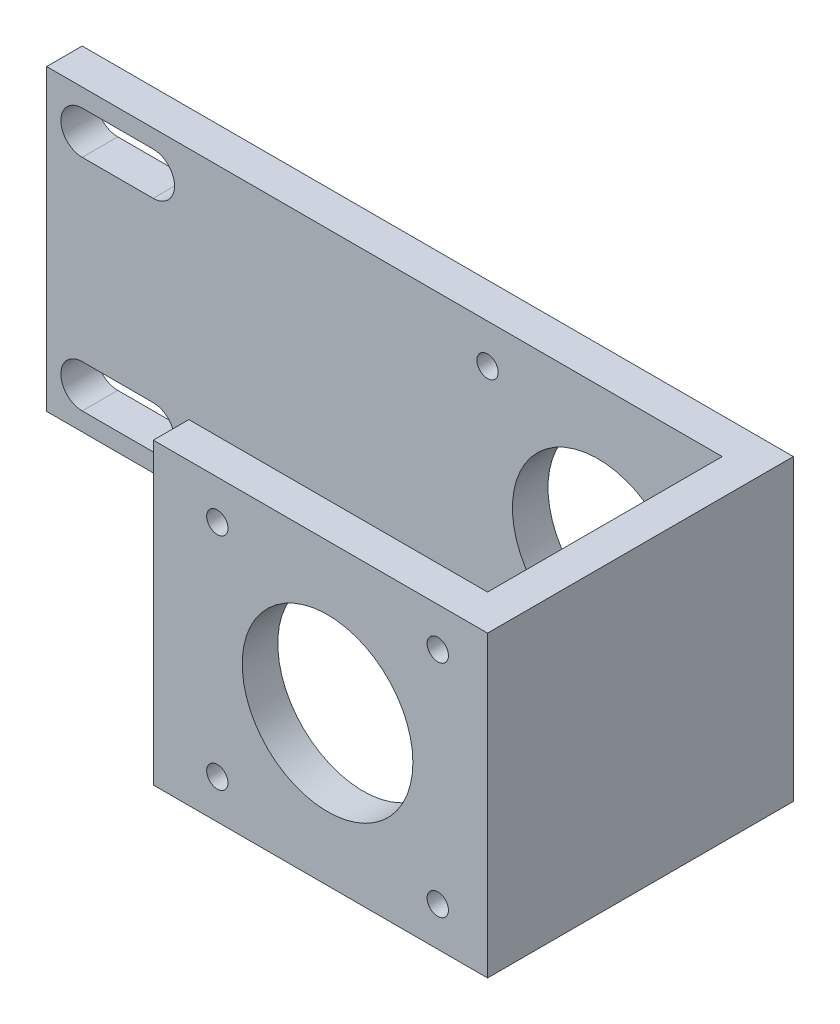
ISO-10303-21;
HEADER;
FILE_DESCRIPTION(('STEP AP214'),'2;1');
FILE_NAME('part.step','',(''),(''),'','','');
FILE_SCHEMA(('AUTOMOTIVE_DESIGN { 1 0 10303 214 1 1 1 1 }'));
ENDSEC;
DATA;
#1=APPLICATION_CONTEXT('core data for automotive mechanical design processes');
#2=APPLICATION_PROTOCOL_DEFINITION('international standard','automotive_design',2000,#1);
#3=PRODUCT_CONTEXT('',#1,'mechanical');
#4=PRODUCT('Part','Part','',(#3));
#5=PRODUCT_RELATED_PRODUCT_CATEGORY('part','',(#4));
#6=PRODUCT_DEFINITION_FORMATION('','',#4);
#7=PRODUCT_DEFINITION_CONTEXT('part definition',#1,'design');
#8=PRODUCT_DEFINITION('design','',#6,#7);
#9=PRODUCT_DEFINITION_SHAPE('','',#8);
#10=(LENGTH_UNIT() NAMED_UNIT(*) SI_UNIT(.MILLI.,.METRE.));
#11=(NAMED_UNIT(*) PLANE_ANGLE_UNIT() SI_UNIT($,.RADIAN.));
#12=(NAMED_UNIT(*) SI_UNIT($,.STERADIAN.) SOLID_ANGLE_UNIT());
#13=UNCERTAINTY_MEASURE_WITH_UNIT(LENGTH_MEASURE(1.E-05),#10,'distance_accuracy_value','');
#14=(GEOMETRIC_REPRESENTATION_CONTEXT(3) GLOBAL_UNCERTAINTY_ASSIGNED_CONTEXT((#13)) GLOBAL_UNIT_ASSIGNED_CONTEXT((#10,
#11,#12)) REPRESENTATION_CONTEXT('',''));
#15=CARTESIAN_POINT('',(0.,0.,0.));
#16=DIRECTION('',(0.,0.,1.));
#17=DIRECTION('',(1.,0.,0.));
#18=AXIS2_PLACEMENT_3D('',#15,#16,#17);
#19=CARTESIAN_POINT('',(45.,21.,43.));
#20=DIRECTION('',(1.,0.,0.));
#21=DIRECTION('',(0.,1.,0.));
#22=AXIS2_PLACEMENT_3D('',#19,#20,#21);
#23=PLANE('',#22);
#24=DIRECTION('',(0.,-1.,0.));
#25=VECTOR('',#24,1.);
#26=CARTESIAN_POINT('',(45.,-21.,38.));
#27=LINE('',#26,#25);
#28=CARTESIAN_POINT('',(45.,21.,38.));
#29=VERTEX_POINT('',#28);
#30=CARTESIAN_POINT('',(45.,-21.,38.));
#31=VERTEX_POINT('',#30);
#32=EDGE_CURVE('E614',#29,#31,#27,.T.);
#33=ORIENTED_EDGE('',*,*,#32,.F.);
#34=DIRECTION('',(0.,0.,-1.));
#35=VECTOR('',#34,1.);
#36=CARTESIAN_POINT('',(45.,21.,43.));
#37=LINE('',#36,#35);
#38=CARTESIAN_POINT('',(45.,21.,5.));
#39=VERTEX_POINT('',#38);
#40=EDGE_CURVE('E54',#29,#39,#37,.T.);
#41=ORIENTED_EDGE('',*,*,#40,.T.);
#42=DIRECTION('',(0.,-1.,0.));
#43=VECTOR('',#42,1.);
#44=CARTESIAN_POINT('',(45.,21.,5.));
#45=LINE('',#44,#43);
#46=CARTESIAN_POINT('',(45.,-21.,5.));
#47=VERTEX_POINT('',#46);
#48=EDGE_CURVE('E234',#39,#47,#45,.T.);
#49=ORIENTED_EDGE('',*,*,#48,.T.);
#50=DIRECTION('',(0.,0.,-1.));
#51=VECTOR('',#50,1.);
#52=CARTESIAN_POINT('',(45.,-21.,43.));
#53=LINE('',#52,#51);
#54=EDGE_CURVE('E243',#31,#47,#53,.T.);
#55=ORIENTED_EDGE('',*,*,#54,.F.);
#56=EDGE_LOOP('',(#33,#41,#49,#55));
#57=FACE_BOUND('',#56,.T.);
#58=ADVANCED_FACE('F37',(#57),#23,.F.);
#59=CARTESIAN_POINT('',(-45.,15.44,5.));
#60=DIRECTION('',(0.,0.,-1.));
#61=DIRECTION('',(-1.,0.,0.));
#62=AXIS2_PLACEMENT_3D('',#59,#60,#61);
#63=CYLINDRICAL_SURFACE('',#62,3.);
#64=CARTESIAN_POINT('',(-45.,15.44,0.));
#65=DIRECTION('',(0.,0.,1.));
#66=DIRECTION('',(1.,0.,0.));
#67=AXIS2_PLACEMENT_3D('',#64,#65,#66);
#68=CIRCLE('',#67,3.);
#69=CARTESIAN_POINT('',(-45.,18.44,0.));
#70=VERTEX_POINT('',#69);
#71=CARTESIAN_POINT('',(-45.,12.44,0.));
#72=VERTEX_POINT('',#71);
#73=EDGE_CURVE('E189',#70,#72,#68,.T.);
#74=ORIENTED_EDGE('',*,*,#73,.F.);
#75=DIRECTION('',(0.,0.,-1.));
#76=VECTOR('',#75,1.);
#77=CARTESIAN_POINT('',(-45.,18.44,5.));
#78=LINE('',#77,#76);
#79=CARTESIAN_POINT('',(-45.,18.44,5.));
#80=VERTEX_POINT('',#79);
#81=EDGE_CURVE('E11',#80,#70,#78,.T.);
#82=ORIENTED_EDGE('',*,*,#81,.F.);
#83=CARTESIAN_POINT('',(-45.,15.44,5.));
#84=DIRECTION('',(0.,0.,1.));
#85=DIRECTION('',(1.,0.,0.));
#86=AXIS2_PLACEMENT_3D('',#83,#84,#85);
#87=CIRCLE('',#86,3.);
#88=CARTESIAN_POINT('',(-45.,12.44,5.));
#89=VERTEX_POINT('',#88);
#90=EDGE_CURVE('E146',#80,#89,#87,.T.);
#91=ORIENTED_EDGE('',*,*,#90,.T.);
#92=DIRECTION('',(0.,0.,-1.));
#93=VECTOR('',#92,1.);
#94=CARTESIAN_POINT('',(-45.,12.44,5.));
#95=LINE('',#94,#93);
#96=EDGE_CURVE('E63',#89,#72,#95,.T.);
#97=ORIENTED_EDGE('',*,*,#96,.T.);
#98=EDGE_LOOP('',(#74,#82,#91,#97));
#99=FACE_BOUND('',#98,.T.);
#100=ADVANCED_FACE('F291',(#99),#63,.F.);
#101=CARTESIAN_POINT('',(0.,18.44,5.));
#102=DIRECTION('',(0.,1.,0.));
#103=DIRECTION('',(0.,0.,1.));
#104=AXIS2_PLACEMENT_3D('',#101,#102,#103);
#105=PLANE('',#104);
#106=DIRECTION('',(1.,0.,0.));
#107=VECTOR('',#106,1.);
#108=CARTESIAN_POINT('',(0.,18.44,0.));
#109=LINE('',#108,#107);
#110=CARTESIAN_POINT('',(-35.0214124085083,18.44,0.));
#111=VERTEX_POINT('',#110);
#112=EDGE_CURVE('E152',#70,#111,#109,.T.);
#113=ORIENTED_EDGE('',*,*,#112,.T.);
#114=DIRECTION('',(0.,0.,-1.));
#115=VECTOR('',#114,1.);
#116=CARTESIAN_POINT('',(-35.0214124085083,18.44,5.));
#117=LINE('',#116,#115);
#118=CARTESIAN_POINT('',(-35.0214124085083,18.44,5.));
#119=VERTEX_POINT('',#118);
#120=EDGE_CURVE('E46',#119,#111,#117,.T.);
#121=ORIENTED_EDGE('',*,*,#120,.F.);
#122=DIRECTION('',(1.,0.,0.));
#123=VECTOR('',#122,1.);
#124=CARTESIAN_POINT('',(0.,18.44,5.));
#125=LINE('',#124,#123);
#126=EDGE_CURVE('E140',#80,#119,#125,.T.);
#127=ORIENTED_EDGE('',*,*,#126,.F.);
#128=ORIENTED_EDGE('',*,*,#81,.T.);
#129=EDGE_LOOP('',(#113,#121,#127,#128));
#130=FACE_BOUND('',#129,.T.);
#131=ADVANCED_FACE('F150',(#130),#105,.F.);
#132=CARTESIAN_POINT('',(-35.0214124085083,15.44,5.));
#133=DIRECTION('',(0.,0.,-1.));
#134=DIRECTION('',(-1.,0.,0.));
#135=AXIS2_PLACEMENT_3D('',#132,#133,#134);
#136=CYLINDRICAL_SURFACE('',#135,3.);
#137=CARTESIAN_POINT('',(-35.0214124085083,15.44,0.));
#138=DIRECTION('',(0.,0.,1.));
#139=DIRECTION('',(1.,0.,0.));
#140=AXIS2_PLACEMENT_3D('',#137,#138,#139);
#141=CIRCLE('',#140,3.);
#142=CARTESIAN_POINT('',(-35.0214124085083,12.44,0.));
#143=VERTEX_POINT('',#142);
#144=EDGE_CURVE('E192',#143,#111,#141,.T.);
#145=ORIENTED_EDGE('',*,*,#144,.F.);
#146=DIRECTION('',(0.,0.,-1.));
#147=VECTOR('',#146,1.);
#148=CARTESIAN_POINT('',(-35.0214124085083,12.44,5.));
#149=LINE('',#148,#147);
#150=CARTESIAN_POINT('',(-35.0214124085083,12.44,5.));
#151=VERTEX_POINT('',#150);
#152=EDGE_CURVE('E156',#151,#143,#149,.T.);
#153=ORIENTED_EDGE('',*,*,#152,.F.);
#154=CARTESIAN_POINT('',(-35.0214124085083,15.44,5.));
#155=DIRECTION('',(0.,0.,1.));
#156=DIRECTION('',(1.,0.,0.));
#157=AXIS2_PLACEMENT_3D('',#154,#155,#156);
#158=CIRCLE('',#157,3.);
#159=EDGE_CURVE('E145',#151,#119,#158,.T.);
#160=ORIENTED_EDGE('',*,*,#159,.T.);
#161=ORIENTED_EDGE('',*,*,#120,.T.);
#162=EDGE_LOOP('',(#145,#153,#160,#161));
#163=FACE_BOUND('',#162,.T.);
#164=ADVANCED_FACE('F158',(#163),#136,.F.);
#165=CARTESIAN_POINT('',(0.,21.,5.));
#166=DIRECTION('',(0.,1.,0.));
#167=DIRECTION('',(-1.,0.,0.));
#168=AXIS2_PLACEMENT_3D('',#165,#166,#167);
#169=PLANE('',#168);
#170=DIRECTION('',(1.,0.,0.));
#171=VECTOR('',#170,1.);
#172=CARTESIAN_POINT('',(0.,21.,0.));
#173=LINE('',#172,#171);
#174=CARTESIAN_POINT('',(-50.,21.,0.));
#175=VERTEX_POINT('',#174);
#176=CARTESIAN_POINT('',(50.,21.,0.));
#177=VERTEX_POINT('',#176);
#178=EDGE_CURVE('E177',#175,#177,#173,.T.);
#179=ORIENTED_EDGE('',*,*,#178,.F.);
#180=DIRECTION('',(0.,0.,-1.));
#181=VECTOR('',#180,1.);
#182=CARTESIAN_POINT('',(-50.,21.,5.));
#183=LINE('',#182,#181);
#184=CARTESIAN_POINT('',(-50.,21.,5.));
#185=VERTEX_POINT('',#184);
#186=EDGE_CURVE('E199',#185,#175,#183,.T.);
#187=ORIENTED_EDGE('',*,*,#186,.F.);
#188=DIRECTION('',(1.,0.,0.));
#189=VECTOR('',#188,1.);
#190=CARTESIAN_POINT('',(0.,21.,5.));
#191=LINE('',#190,#189);
#192=EDGE_CURVE('E215',#185,#39,#191,.T.);
#193=ORIENTED_EDGE('',*,*,#192,.T.);
#194=ORIENTED_EDGE('',*,*,#40,.F.);
#195=DIRECTION('',(1.,0.,0.));
#196=VECTOR('',#195,1.);
#197=CARTESIAN_POINT('',(3.,21.,38.));
#198=LINE('',#197,#196);
#199=CARTESIAN_POINT('',(3.,21.,38.));
#200=VERTEX_POINT('',#199);
#201=EDGE_CURVE('E245',#200,#29,#198,.T.);
#202=ORIENTED_EDGE('',*,*,#201,.F.);
#203=DIRECTION('',(0.,0.,-1.));
#204=VECTOR('',#203,1.);
#205=CARTESIAN_POINT('',(3.,21.,43.));
#206=LINE('',#205,#204);
#207=CARTESIAN_POINT('',(3.,21.,43.));
#208=VERTEX_POINT('',#207);
#209=EDGE_CURVE('E618',#208,#200,#206,.T.);
#210=ORIENTED_EDGE('',*,*,#209,.F.);
#211=DIRECTION('',(-1.,0.,0.));
#212=VECTOR('',#211,1.);
#213=CARTESIAN_POINT('',(50.,21.,43.));
#214=LINE('',#213,#212);
#215=CARTESIAN_POINT('',(50.,21.,43.));
#216=VERTEX_POINT('',#215);
#217=EDGE_CURVE('E247',#216,#208,#214,.T.);
#218=ORIENTED_EDGE('',*,*,#217,.F.);
#219=DIRECTION('',(0.,0.,-1.));
#220=VECTOR('',#219,1.);
#221=CARTESIAN_POINT('',(50.,21.,5.));
#222=LINE('',#221,#220);
#223=EDGE_CURVE('E201',#216,#177,#222,.T.);
#224=ORIENTED_EDGE('',*,*,#223,.T.);
#225=EDGE_LOOP('',(#179,#187,#193,#194,#202,#210,#218,#224));
#226=FACE_BOUND('',#225,.T.);
#227=ADVANCED_FACE('F312',(#226),#169,.T.);
#228=CARTESIAN_POINT('',(-50.,0.,5.));
#229=DIRECTION('',(1.,0.,0.));
#230=DIRECTION('',(0.,0.,-1.));
#231=AXIS2_PLACEMENT_3D('',#228,#229,#230);
#232=PLANE('',#231);
#233=DIRECTION('',(0.,-1.,0.));
#234=VECTOR('',#233,1.);
#235=CARTESIAN_POINT('',(-50.,0.,0.));
#236=LINE('',#235,#234);
#237=CARTESIAN_POINT('',(-50.,-21.,0.));
#238=VERTEX_POINT('',#237);
#239=EDGE_CURVE('E180',#175,#238,#236,.T.);
#240=ORIENTED_EDGE('',*,*,#239,.T.);
#241=DIRECTION('',(0.,0.,-1.));
#242=VECTOR('',#241,1.);
#243=CARTESIAN_POINT('',(-50.,-21.,5.));
#244=LINE('',#243,#242);
#245=CARTESIAN_POINT('',(-50.,-21.,5.));
#246=VERTEX_POINT('',#245);
#247=EDGE_CURVE('E205',#246,#238,#244,.T.);
#248=ORIENTED_EDGE('',*,*,#247,.F.);
#249=DIRECTION('',(0.,-1.,0.));
#250=VECTOR('',#249,1.);
#251=CARTESIAN_POINT('',(-50.,0.,5.));
#252=LINE('',#251,#250);
#253=EDGE_CURVE('E219',#185,#246,#252,.T.);
#254=ORIENTED_EDGE('',*,*,#253,.F.);
#255=ORIENTED_EDGE('',*,*,#186,.T.);
#256=EDGE_LOOP('',(#240,#248,#254,#255));
#257=FACE_BOUND('',#256,.T.);
#258=ADVANCED_FACE('F288',(#257),#232,.F.);
#259=CARTESIAN_POINT('',(0.,-21.,5.));
#260=DIRECTION('',(0.,1.,0.));
#261=DIRECTION('',(0.,0.,1.));
#262=AXIS2_PLACEMENT_3D('',#259,#260,#261);
#263=PLANE('',#262);
#264=DIRECTION('',(1.,0.,0.));
#265=VECTOR('',#264,1.);
#266=CARTESIAN_POINT('',(0.,-21.,0.));
#267=LINE('',#266,#265);
#268=CARTESIAN_POINT('',(50.,-21.,0.));
#269=VERTEX_POINT('',#268);
#270=EDGE_CURVE('E183',#238,#269,#267,.T.);
#271=ORIENTED_EDGE('',*,*,#270,.T.);
#272=DIRECTION('',(0.,0.,-1.));
#273=VECTOR('',#272,1.);
#274=CARTESIAN_POINT('',(50.,-21.,5.));
#275=LINE('',#274,#273);
#276=CARTESIAN_POINT('',(50.,-21.,43.));
#277=VERTEX_POINT('',#276);
#278=EDGE_CURVE('E203',#277,#269,#275,.T.);
#279=ORIENTED_EDGE('',*,*,#278,.F.);
#280=DIRECTION('',(1.,0.,0.));
#281=VECTOR('',#280,1.);
#282=CARTESIAN_POINT('',(50.,-21.,43.));
#283=LINE('',#282,#281);
#284=CARTESIAN_POINT('',(3.,-21.,43.));
#285=VERTEX_POINT('',#284);
#286=EDGE_CURVE('E259',#285,#277,#283,.T.);
#287=ORIENTED_EDGE('',*,*,#286,.F.);
#288=DIRECTION('',(0.,0.,1.));
#289=VECTOR('',#288,1.);
#290=CARTESIAN_POINT('',(3.,-21.,43.));
#291=LINE('',#290,#289);
#292=CARTESIAN_POINT('',(3.,-21.,38.));
#293=VERTEX_POINT('',#292);
#294=EDGE_CURVE('E624',#293,#285,#291,.T.);
#295=ORIENTED_EDGE('',*,*,#294,.F.);
#296=DIRECTION('',(1.,0.,0.));
#297=VECTOR('',#296,1.);
#298=CARTESIAN_POINT('',(3.,-21.,38.));
#299=LINE('',#298,#297);
#300=EDGE_CURVE('E250',#293,#31,#299,.T.);
#301=ORIENTED_EDGE('',*,*,#300,.T.);
#302=ORIENTED_EDGE('',*,*,#54,.T.);
#303=DIRECTION('',(1.,0.,0.));
#304=VECTOR('',#303,1.);
#305=CARTESIAN_POINT('',(0.,-21.,5.));
#306=LINE('',#305,#304);
#307=EDGE_CURVE('E221',#246,#47,#306,.T.);
#308=ORIENTED_EDGE('',*,*,#307,.F.);
#309=ORIENTED_EDGE('',*,*,#247,.T.);
#310=EDGE_LOOP('',(#271,#279,#287,#295,#301,#302,#308,#309));
#311=FACE_BOUND('',#310,.T.);
#312=ADVANCED_FACE('F283',(#311),#263,.F.);
#313=CARTESIAN_POINT('',(0.,-18.44,5.));
#314=DIRECTION('',(0.,1.,0.));
#315=DIRECTION('',(0.,0.,1.));
#316=AXIS2_PLACEMENT_3D('',#313,#314,#315);
#317=PLANE('',#316);
#318=DIRECTION('',(1.,0.,0.));
#319=VECTOR('',#318,1.);
#320=CARTESIAN_POINT('',(0.,-18.44,0.));
#321=LINE('',#320,#319);
#322=CARTESIAN_POINT('',(-45.,-18.44,0.));
#323=VERTEX_POINT('',#322);
#324=CARTESIAN_POINT('',(-35.0214124085083,-18.44,0.));
#325=VERTEX_POINT('',#324);
#326=EDGE_CURVE('E165',#323,#325,#321,.T.);
#327=ORIENTED_EDGE('',*,*,#326,.F.);
#328=DIRECTION('',(0.,0.,-1.));
#329=VECTOR('',#328,1.);
#330=CARTESIAN_POINT('',(-45.,-18.44,5.));
#331=LINE('',#330,#329);
#332=CARTESIAN_POINT('',(-45.,-18.44,5.));
#333=VERTEX_POINT('',#332);
#334=EDGE_CURVE('E113',#333,#323,#331,.T.);
#335=ORIENTED_EDGE('',*,*,#334,.F.);
#336=DIRECTION('',(1.,0.,0.));
#337=VECTOR('',#336,1.);
#338=CARTESIAN_POINT('',(0.,-18.44,5.));
#339=LINE('',#338,#337);
#340=CARTESIAN_POINT('',(-35.0214124085083,-18.44,5.));
#341=VERTEX_POINT('',#340);
#342=EDGE_CURVE('E197',#333,#341,#339,.T.);
#343=ORIENTED_EDGE('',*,*,#342,.T.);
#344=DIRECTION('',(0.,0.,-1.));
#345=VECTOR('',#344,1.);
#346=CARTESIAN_POINT('',(-35.0214124085083,-18.44,5.));
#347=LINE('',#346,#345);
#348=EDGE_CURVE('E161',#341,#325,#347,.T.);
#349=ORIENTED_EDGE('',*,*,#348,.T.);
#350=EDGE_LOOP('',(#327,#335,#343,#349));
#351=FACE_BOUND('',#350,.T.);
#352=ADVANCED_FACE('F39',(#351),#317,.T.);
#353=CARTESIAN_POINT('',(-45.,-15.44,5.));
#354=DIRECTION('',(0.,0.,-1.));
#355=DIRECTION('',(-1.,0.,0.));
#356=AXIS2_PLACEMENT_3D('',#353,#354,#355);
#357=CYLINDRICAL_SURFACE('',#356,3.);
#358=CARTESIAN_POINT('',(-45.,-15.44,0.));
#359=DIRECTION('',(0.,0.,1.));
#360=DIRECTION('',(1.,0.,0.));
#361=AXIS2_PLACEMENT_3D('',#358,#359,#360);
#362=CIRCLE('',#361,3.);
#363=CARTESIAN_POINT('',(-45.,-12.44,0.));
#364=VERTEX_POINT('',#363);
#365=EDGE_CURVE('E168',#364,#323,#362,.T.);
#366=ORIENTED_EDGE('',*,*,#365,.F.);
#367=DIRECTION('',(0.,0.,-1.));
#368=VECTOR('',#367,1.);
#369=CARTESIAN_POINT('',(-45.,-12.44,5.));
#370=LINE('',#369,#368);
#371=CARTESIAN_POINT('',(-45.,-12.44,5.));
#372=VERTEX_POINT('',#371);
#373=EDGE_CURVE('E212',#372,#364,#370,.T.);
#374=ORIENTED_EDGE('',*,*,#373,.F.);
#375=CARTESIAN_POINT('',(-45.,-15.44,5.));
#376=DIRECTION('',(0.,0.,1.));
#377=DIRECTION('',(1.,0.,0.));
#378=AXIS2_PLACEMENT_3D('',#375,#376,#377);
#379=CIRCLE('',#378,3.);
#380=EDGE_CURVE('E262',#372,#333,#379,.T.);
#381=ORIENTED_EDGE('',*,*,#380,.T.);
#382=ORIENTED_EDGE('',*,*,#334,.T.);
#383=EDGE_LOOP('',(#366,#374,#381,#382));
#384=FACE_BOUND('',#383,.T.);
#385=ADVANCED_FACE('F275',(#384),#357,.F.);
#386=CARTESIAN_POINT('',(0.,-12.44,5.));
#387=DIRECTION('',(0.,1.,0.));
#388=DIRECTION('',(0.,0.,1.));
#389=AXIS2_PLACEMENT_3D('',#386,#387,#388);
#390=PLANE('',#389);
#391=DIRECTION('',(1.,0.,0.));
#392=VECTOR('',#391,1.);
#393=CARTESIAN_POINT('',(0.,-12.44,0.));
#394=LINE('',#393,#392);
#395=CARTESIAN_POINT('',(-35.0214124085083,-12.44,0.));
#396=VERTEX_POINT('',#395);
#397=EDGE_CURVE('E171',#364,#396,#394,.T.);
#398=ORIENTED_EDGE('',*,*,#397,.T.);
#399=DIRECTION('',(0.,0.,-1.));
#400=VECTOR('',#399,1.);
#401=CARTESIAN_POINT('',(-35.0214124085083,-12.44,5.));
#402=LINE('',#401,#400);
#403=CARTESIAN_POINT('',(-35.0214124085083,-12.44,5.));
#404=VERTEX_POINT('',#403);
#405=EDGE_CURVE('E210',#404,#396,#402,.T.);
#406=ORIENTED_EDGE('',*,*,#405,.F.);
#407=DIRECTION('',(1.,0.,0.));
#408=VECTOR('',#407,1.);
#409=CARTESIAN_POINT('',(0.,-12.44,5.));
#410=LINE('',#409,#408);
#411=EDGE_CURVE('E264',#372,#404,#410,.T.);
#412=ORIENTED_EDGE('',*,*,#411,.F.);
#413=ORIENTED_EDGE('',*,*,#373,.T.);
#414=EDGE_LOOP('',(#398,#406,#412,#413));
#415=FACE_BOUND('',#414,.T.);
#416=ADVANCED_FACE('F278',(#415),#390,.F.);
#417=CARTESIAN_POINT('',(50.,0.,5.));
#418=DIRECTION('',(1.,0.,0.));
#419=DIRECTION('',(0.,0.,-1.));
#420=AXIS2_PLACEMENT_3D('',#417,#418,#419);
#421=PLANE('',#420);
#422=DIRECTION('',(0.,-1.,0.));
#423=VECTOR('',#422,1.);
#424=CARTESIAN_POINT('',(50.,0.,0.));
#425=LINE('',#424,#423);
#426=EDGE_CURVE('E186',#177,#269,#425,.T.);
#427=ORIENTED_EDGE('',*,*,#426,.F.);
#428=ORIENTED_EDGE('',*,*,#223,.F.);
#429=DIRECTION('',(0.,1.,0.));
#430=VECTOR('',#429,1.);
#431=CARTESIAN_POINT('',(50.,21.,43.));
#432=LINE('',#431,#430);
#433=EDGE_CURVE('E244',#277,#216,#432,.T.);
#434=ORIENTED_EDGE('',*,*,#433,.F.);
#435=ORIENTED_EDGE('',*,*,#278,.T.);
#436=EDGE_LOOP('',(#427,#428,#434,#435));
#437=FACE_BOUND('',#436,.T.);
#438=ADVANCED_FACE('F315',(#437),#421,.T.);
#439=CARTESIAN_POINT('',(-35.0214124085083,-15.44,5.));
#440=DIRECTION('',(0.,0.,-1.));
#441=DIRECTION('',(-1.,0.,0.));
#442=AXIS2_PLACEMENT_3D('',#439,#440,#441);
#443=CYLINDRICAL_SURFACE('',#442,3.);
#444=CARTESIAN_POINT('',(-35.0214124085083,-15.44,0.));
#445=DIRECTION('',(0.,0.,1.));
#446=DIRECTION('',(1.,0.,0.));
#447=AXIS2_PLACEMENT_3D('',#444,#445,#446);
#448=CIRCLE('',#447,3.);
#449=EDGE_CURVE('E174',#325,#396,#448,.T.);
#450=ORIENTED_EDGE('',*,*,#449,.F.);
#451=ORIENTED_EDGE('',*,*,#348,.F.);
#452=CARTESIAN_POINT('',(-35.0214124085083,-15.44,5.));
#453=DIRECTION('',(0.,0.,1.));
#454=DIRECTION('',(1.,0.,0.));
#455=AXIS2_PLACEMENT_3D('',#452,#453,#454);
#456=CIRCLE('',#455,3.);
#457=EDGE_CURVE('E220',#341,#404,#456,.T.);
#458=ORIENTED_EDGE('',*,*,#457,.T.);
#459=ORIENTED_EDGE('',*,*,#405,.T.);
#460=EDGE_LOOP('',(#450,#451,#458,#459));
#461=FACE_BOUND('',#460,.T.);
#462=ADVANCED_FACE('F272',(#461),#443,.F.);
#463=CARTESIAN_POINT('',(0.,12.44,5.));
#464=DIRECTION('',(0.,1.,0.));
#465=DIRECTION('',(0.,0.,1.));
#466=AXIS2_PLACEMENT_3D('',#463,#464,#465);
#467=PLANE('',#466);
#468=DIRECTION('',(1.,0.,0.));
#469=VECTOR('',#468,1.);
#470=CARTESIAN_POINT('',(0.,12.44,0.));
#471=LINE('',#470,#469);
#472=EDGE_CURVE('E194',#72,#143,#471,.T.);
#473=ORIENTED_EDGE('',*,*,#472,.F.);
#474=ORIENTED_EDGE('',*,*,#96,.F.);
#475=DIRECTION('',(1.,0.,0.));
#476=VECTOR('',#475,1.);
#477=CARTESIAN_POINT('',(0.,12.44,5.));
#478=LINE('',#477,#476);
#479=EDGE_CURVE('E159',#89,#151,#478,.T.);
#480=ORIENTED_EDGE('',*,*,#479,.T.);
#481=ORIENTED_EDGE('',*,*,#152,.T.);
#482=EDGE_LOOP('',(#473,#474,#480,#481));
#483=FACE_BOUND('',#482,.T.);
#484=ADVANCED_FACE('F303',(#483),#467,.T.);
#485=CARTESIAN_POINT('',(0.,0.,5.));
#486=DIRECTION('',(0.,0.,1.));
#487=DIRECTION('',(1.,0.,0.));
#488=AXIS2_PLACEMENT_3D('',#485,#486,#487);
#489=PLANE('',#488);
#490=CARTESIAN_POINT('',(27.5,0.,5.));
#491=DIRECTION('',(0.,0.,1.));
#492=DIRECTION('',(1.,0.,0.));
#493=AXIS2_PLACEMENT_3D('',#490,#491,#492);
#494=CIRCLE('',#493,12.);
#495=CARTESIAN_POINT('',(39.5,0.,5.));
#496=VERTEX_POINT('',#495);
#497=EDGE_CURVE('E563',#496,#496,#494,.T.);
#498=ORIENTED_EDGE('',*,*,#497,.F.);
#499=EDGE_LOOP('',(#498));
#500=FACE_BOUND('',#499,.T.);
#501=CARTESIAN_POINT('',(43.,-15.5,5.));
#502=DIRECTION('',(0.,0.,1.));
#503=DIRECTION('',(1.,0.,0.));
#504=AXIS2_PLACEMENT_3D('',#501,#502,#503);
#505=CIRCLE('',#504,1.5);
#506=CARTESIAN_POINT('',(44.5,-15.5,5.));
#507=VERTEX_POINT('',#506);
#508=EDGE_CURVE('E581',#507,#507,#505,.T.);
#509=ORIENTED_EDGE('',*,*,#508,.F.);
#510=EDGE_LOOP('',(#509));
#511=FACE_BOUND('',#510,.T.);
#512=CARTESIAN_POINT('',(43.,15.5,5.));
#513=DIRECTION('',(0.,0.,1.));
#514=DIRECTION('',(1.,0.,0.));
#515=AXIS2_PLACEMENT_3D('',#512,#513,#514);
#516=CIRCLE('',#515,1.5);
#517=CARTESIAN_POINT('',(44.5,15.5,5.));
#518=VERTEX_POINT('',#517);
#519=EDGE_CURVE('E591',#518,#518,#516,.T.);
#520=ORIENTED_EDGE('',*,*,#519,.F.);
#521=EDGE_LOOP('',(#520));
#522=FACE_BOUND('',#521,.T.);
#523=CARTESIAN_POINT('',(12.,15.5,5.));
#524=DIRECTION('',(0.,0.,1.));
#525=DIRECTION('',(1.,0.,0.));
#526=AXIS2_PLACEMENT_3D('',#523,#524,#525);
#527=CIRCLE('',#526,1.5);
#528=CARTESIAN_POINT('',(13.5,15.5,5.));
#529=VERTEX_POINT('',#528);
#530=EDGE_CURVE('E601',#529,#529,#527,.T.);
#531=ORIENTED_EDGE('',*,*,#530,.F.);
#532=EDGE_LOOP('',(#531));
#533=FACE_BOUND('',#532,.T.);
#534=CARTESIAN_POINT('',(12.,-15.5,5.));
#535=DIRECTION('',(0.,0.,1.));
#536=DIRECTION('',(1.,0.,0.));
#537=AXIS2_PLACEMENT_3D('',#534,#535,#536);
#538=CIRCLE('',#537,1.5);
#539=CARTESIAN_POINT('',(13.5,-15.5,5.));
#540=VERTEX_POINT('',#539);
#541=EDGE_CURVE('E611',#540,#540,#538,.T.);
#542=ORIENTED_EDGE('',*,*,#541,.F.);
#543=EDGE_LOOP('',(#542));
#544=FACE_BOUND('',#543,.T.);
#545=ORIENTED_EDGE('',*,*,#48,.F.);
#546=ORIENTED_EDGE('',*,*,#192,.F.);
#547=ORIENTED_EDGE('',*,*,#253,.T.);
#548=ORIENTED_EDGE('',*,*,#307,.T.);
#549=EDGE_LOOP('',(#545,#546,#547,#548));
#550=FACE_BOUND('',#549,.T.);
#551=ORIENTED_EDGE('',*,*,#342,.F.);
#552=ORIENTED_EDGE('',*,*,#380,.F.);
#553=ORIENTED_EDGE('',*,*,#411,.T.);
#554=ORIENTED_EDGE('',*,*,#457,.F.);
#555=EDGE_LOOP('',(#551,#552,#553,#554));
#556=FACE_BOUND('',#555,.T.);
#557=ORIENTED_EDGE('',*,*,#90,.F.);
#558=ORIENTED_EDGE('',*,*,#126,.T.);
#559=ORIENTED_EDGE('',*,*,#159,.F.);
#560=ORIENTED_EDGE('',*,*,#479,.F.);
#561=EDGE_LOOP('',(#557,#558,#559,#560));
#562=FACE_BOUND('',#561,.T.);
#563=ADVANCED_FACE('F142',(#500,#511,#522,#533,#544,#550,#556,#562),#489,.T.);
#564=CARTESIAN_POINT('',(0.,0.,0.));
#565=DIRECTION('',(0.,0.,1.));
#566=DIRECTION('',(1.,0.,0.));
#567=AXIS2_PLACEMENT_3D('',#564,#565,#566);
#568=PLANE('',#567);
#569=CARTESIAN_POINT('',(27.5,0.,0.));
#570=DIRECTION('',(0.,0.,1.));
#571=DIRECTION('',(1.,0.,0.));
#572=AXIS2_PLACEMENT_3D('',#569,#570,#571);
#573=CIRCLE('',#572,12.);
#574=CARTESIAN_POINT('',(39.5,0.,0.));
#575=VERTEX_POINT('',#574);
#576=EDGE_CURVE('E566',#575,#575,#573,.F.);
#577=ORIENTED_EDGE('',*,*,#576,.F.);
#578=EDGE_LOOP('',(#577));
#579=FACE_BOUND('',#578,.T.);
#580=CARTESIAN_POINT('',(43.,-15.5,0.));
#581=DIRECTION('',(0.,0.,1.));
#582=DIRECTION('',(1.,0.,0.));
#583=AXIS2_PLACEMENT_3D('',#580,#581,#582);
#584=CIRCLE('',#583,1.5);
#585=CARTESIAN_POINT('',(44.5,-15.5,0.));
#586=VERTEX_POINT('',#585);
#587=EDGE_CURVE('E574',#586,#586,#584,.F.);
#588=ORIENTED_EDGE('',*,*,#587,.F.);
#589=EDGE_LOOP('',(#588));
#590=FACE_BOUND('',#589,.T.);
#591=CARTESIAN_POINT('',(43.,15.5,0.));
#592=DIRECTION('',(0.,0.,1.));
#593=DIRECTION('',(1.,0.,0.));
#594=AXIS2_PLACEMENT_3D('',#591,#592,#593);
#595=CIRCLE('',#594,1.5);
#596=CARTESIAN_POINT('',(44.5,15.5,0.));
#597=VERTEX_POINT('',#596);
#598=EDGE_CURVE('E584',#597,#597,#595,.F.);
#599=ORIENTED_EDGE('',*,*,#598,.F.);
#600=EDGE_LOOP('',(#599));
#601=FACE_BOUND('',#600,.T.);
#602=CARTESIAN_POINT('',(12.,15.5,0.));
#603=DIRECTION('',(0.,0.,1.));
#604=DIRECTION('',(1.,0.,0.));
#605=AXIS2_PLACEMENT_3D('',#602,#603,#604);
#606=CIRCLE('',#605,1.5);
#607=CARTESIAN_POINT('',(13.5,15.5,0.));
#608=VERTEX_POINT('',#607);
#609=EDGE_CURVE('E594',#608,#608,#606,.F.);
#610=ORIENTED_EDGE('',*,*,#609,.F.);
#611=EDGE_LOOP('',(#610));
#612=FACE_BOUND('',#611,.T.);
#613=CARTESIAN_POINT('',(12.,-15.5,0.));
#614=DIRECTION('',(0.,0.,1.));
#615=DIRECTION('',(1.,0.,0.));
#616=AXIS2_PLACEMENT_3D('',#613,#614,#615);
#617=CIRCLE('',#616,1.5);
#618=CARTESIAN_POINT('',(13.5,-15.5,0.));
#619=VERTEX_POINT('',#618);
#620=EDGE_CURVE('E607',#619,#619,#617,.F.);
#621=ORIENTED_EDGE('',*,*,#620,.F.);
#622=EDGE_LOOP('',(#621));
#623=FACE_BOUND('',#622,.T.);
#624=ORIENTED_EDGE('',*,*,#326,.T.);
#625=ORIENTED_EDGE('',*,*,#449,.T.);
#626=ORIENTED_EDGE('',*,*,#397,.F.);
#627=ORIENTED_EDGE('',*,*,#365,.T.);
#628=EDGE_LOOP('',(#624,#625,#626,#627));
#629=FACE_BOUND('',#628,.T.);
#630=ORIENTED_EDGE('',*,*,#178,.T.);
#631=ORIENTED_EDGE('',*,*,#426,.T.);
#632=ORIENTED_EDGE('',*,*,#270,.F.);
#633=ORIENTED_EDGE('',*,*,#239,.F.);
#634=EDGE_LOOP('',(#630,#631,#632,#633));
#635=FACE_BOUND('',#634,.T.);
#636=ORIENTED_EDGE('',*,*,#73,.T.);
#637=ORIENTED_EDGE('',*,*,#472,.T.);
#638=ORIENTED_EDGE('',*,*,#144,.T.);
#639=ORIENTED_EDGE('',*,*,#112,.F.);
#640=EDGE_LOOP('',(#636,#637,#638,#639));
#641=FACE_BOUND('',#640,.T.);
#642=ADVANCED_FACE('F280',(#579,#590,#601,#612,#623,#629,#635,#641),#568,.F.);
#643=CARTESIAN_POINT('',(0.,0.,43.));
#644=DIRECTION('',(0.,0.,-1.));
#645=DIRECTION('',(-1.,0.,0.));
#646=AXIS2_PLACEMENT_3D('',#643,#644,#645);
#647=PLANE('',#646);
#648=CARTESIAN_POINT('',(27.5,0.,43.));
#649=DIRECTION('',(0.,0.,1.));
#650=DIRECTION('',(1.,0.,0.));
#651=AXIS2_PLACEMENT_3D('',#648,#649,#650);
#652=CIRCLE('',#651,12.);
#653=CARTESIAN_POINT('',(39.5,0.,43.));
#654=VERTEX_POINT('',#653);
#655=EDGE_CURVE('E567',#654,#654,#652,.T.);
#656=ORIENTED_EDGE('',*,*,#655,.F.);
#657=EDGE_LOOP('',(#656));
#658=FACE_BOUND('',#657,.T.);
#659=CARTESIAN_POINT('',(43.,-15.5,43.));
#660=DIRECTION('',(0.,0.,1.));
#661=DIRECTION('',(1.,0.,0.));
#662=AXIS2_PLACEMENT_3D('',#659,#660,#661);
#663=CIRCLE('',#662,1.5);
#664=CARTESIAN_POINT('',(44.5,-15.5,43.));
#665=VERTEX_POINT('',#664);
#666=EDGE_CURVE('E577',#665,#665,#663,.T.);
#667=ORIENTED_EDGE('',*,*,#666,.F.);
#668=EDGE_LOOP('',(#667));
#669=FACE_BOUND('',#668,.T.);
#670=CARTESIAN_POINT('',(43.,15.5,43.));
#671=DIRECTION('',(0.,0.,1.));
#672=DIRECTION('',(1.,0.,0.));
#673=AXIS2_PLACEMENT_3D('',#670,#671,#672);
#674=CIRCLE('',#673,1.5);
#675=CARTESIAN_POINT('',(44.5,15.5,43.));
#676=VERTEX_POINT('',#675);
#677=EDGE_CURVE('E587',#676,#676,#674,.T.);
#678=ORIENTED_EDGE('',*,*,#677,.F.);
#679=EDGE_LOOP('',(#678));
#680=FACE_BOUND('',#679,.T.);
#681=CARTESIAN_POINT('',(12.,15.5,43.));
#682=DIRECTION('',(0.,0.,1.));
#683=DIRECTION('',(1.,0.,0.));
#684=AXIS2_PLACEMENT_3D('',#681,#682,#683);
#685=CIRCLE('',#684,1.5);
#686=CARTESIAN_POINT('',(13.5,15.5,43.));
#687=VERTEX_POINT('',#686);
#688=EDGE_CURVE('E597',#687,#687,#685,.T.);
#689=ORIENTED_EDGE('',*,*,#688,.F.);
#690=EDGE_LOOP('',(#689));
#691=FACE_BOUND('',#690,.T.);
#692=CARTESIAN_POINT('',(12.,-15.5,43.));
#693=DIRECTION('',(0.,0.,1.));
#694=DIRECTION('',(1.,0.,0.));
#695=AXIS2_PLACEMENT_3D('',#692,#693,#694);
#696=CIRCLE('',#695,1.5);
#697=CARTESIAN_POINT('',(13.5,-15.5,43.));
#698=VERTEX_POINT('',#697);
#699=EDGE_CURVE('E604',#698,#698,#696,.T.);
#700=ORIENTED_EDGE('',*,*,#699,.F.);
#701=EDGE_LOOP('',(#700));
#702=FACE_BOUND('',#701,.T.);
#703=ORIENTED_EDGE('',*,*,#433,.T.);
#704=ORIENTED_EDGE('',*,*,#217,.T.);
#705=DIRECTION('',(0.,1.,0.));
#706=VECTOR('',#705,1.);
#707=CARTESIAN_POINT('',(3.,-21.,43.));
#708=LINE('',#707,#706);
#709=EDGE_CURVE('E615',#285,#208,#708,.T.);
#710=ORIENTED_EDGE('',*,*,#709,.F.);
#711=ORIENTED_EDGE('',*,*,#286,.T.);
#712=EDGE_LOOP('',(#703,#704,#710,#711));
#713=FACE_BOUND('',#712,.T.);
#714=ADVANCED_FACE('F299',(#658,#669,#680,#691,#702,#713),#647,.F.);
#715=CARTESIAN_POINT('',(3.,-21.,38.));
#716=DIRECTION('',(0.,0.,1.));
#717=DIRECTION('',(1.,0.,0.));
#718=AXIS2_PLACEMENT_3D('',#715,#716,#717);
#719=PLANE('',#718);
#720=CARTESIAN_POINT('',(27.5,0.,38.));
#721=DIRECTION('',(0.,0.,1.));
#722=DIRECTION('',(1.,0.,0.));
#723=AXIS2_PLACEMENT_3D('',#720,#721,#722);
#724=CIRCLE('',#723,12.);
#725=CARTESIAN_POINT('',(39.5,0.,38.));
#726=VERTEX_POINT('',#725);
#727=EDGE_CURVE('E41',#726,#726,#724,.T.);
#728=ORIENTED_EDGE('',*,*,#727,.T.);
#729=EDGE_LOOP('',(#728));
#730=FACE_BOUND('',#729,.T.);
#731=CARTESIAN_POINT('',(43.,-15.5,38.));
#732=DIRECTION('',(0.,0.,1.));
#733=DIRECTION('',(1.,0.,0.));
#734=AXIS2_PLACEMENT_3D('',#731,#732,#733);
#735=CIRCLE('',#734,1.5);
#736=CARTESIAN_POINT('',(44.5,-15.5,38.));
#737=VERTEX_POINT('',#736);
#738=EDGE_CURVE('E580',#737,#737,#735,.T.);
#739=ORIENTED_EDGE('',*,*,#738,.T.);
#740=EDGE_LOOP('',(#739));
#741=FACE_BOUND('',#740,.T.);
#742=CARTESIAN_POINT('',(43.,15.5,38.));
#743=DIRECTION('',(0.,0.,1.));
#744=DIRECTION('',(1.,0.,0.));
#745=AXIS2_PLACEMENT_3D('',#742,#743,#744);
#746=CIRCLE('',#745,1.5);
#747=CARTESIAN_POINT('',(44.5,15.5,38.));
#748=VERTEX_POINT('',#747);
#749=EDGE_CURVE('E590',#748,#748,#746,.T.);
#750=ORIENTED_EDGE('',*,*,#749,.T.);
#751=EDGE_LOOP('',(#750));
#752=FACE_BOUND('',#751,.T.);
#753=CARTESIAN_POINT('',(12.,15.5,38.));
#754=DIRECTION('',(0.,0.,1.));
#755=DIRECTION('',(1.,0.,0.));
#756=AXIS2_PLACEMENT_3D('',#753,#754,#755);
#757=CIRCLE('',#756,1.5);
#758=CARTESIAN_POINT('',(13.5,15.5,38.));
#759=VERTEX_POINT('',#758);
#760=EDGE_CURVE('E600',#759,#759,#757,.T.);
#761=ORIENTED_EDGE('',*,*,#760,.T.);
#762=EDGE_LOOP('',(#761));
#763=FACE_BOUND('',#762,.T.);
#764=CARTESIAN_POINT('',(12.,-15.5,38.));
#765=DIRECTION('',(0.,0.,1.));
#766=DIRECTION('',(1.,0.,0.));
#767=AXIS2_PLACEMENT_3D('',#764,#765,#766);
#768=CIRCLE('',#767,1.5);
#769=CARTESIAN_POINT('',(13.5,-15.5,38.));
#770=VERTEX_POINT('',#769);
#771=EDGE_CURVE('E610',#770,#770,#768,.T.);
#772=ORIENTED_EDGE('',*,*,#771,.T.);
#773=EDGE_LOOP('',(#772));
#774=FACE_BOUND('',#773,.T.);
#775=ORIENTED_EDGE('',*,*,#32,.T.);
#776=ORIENTED_EDGE('',*,*,#300,.F.);
#777=DIRECTION('',(0.,-1.,0.));
#778=VECTOR('',#777,1.);
#779=CARTESIAN_POINT('',(3.,-21.,38.));
#780=LINE('',#779,#778);
#781=EDGE_CURVE('E621',#200,#293,#780,.T.);
#782=ORIENTED_EDGE('',*,*,#781,.F.);
#783=ORIENTED_EDGE('',*,*,#201,.T.);
#784=EDGE_LOOP('',(#775,#776,#782,#783));
#785=FACE_BOUND('',#784,.T.);
#786=ADVANCED_FACE('F359',(#730,#741,#752,#763,#774,#785),#719,.F.);
#787=CARTESIAN_POINT('',(3.,0.,0.));
#788=DIRECTION('',(-1.,0.,0.));
#789=DIRECTION('',(0.,0.,1.));
#790=AXIS2_PLACEMENT_3D('',#787,#788,#789);
#791=PLANE('',#790);
#792=ORIENTED_EDGE('',*,*,#709,.T.);
#793=ORIENTED_EDGE('',*,*,#209,.T.);
#794=ORIENTED_EDGE('',*,*,#781,.T.);
#795=ORIENTED_EDGE('',*,*,#294,.T.);
#796=EDGE_LOOP('',(#792,#793,#794,#795));
#797=FACE_BOUND('',#796,.T.);
#798=ADVANCED_FACE('F366',(#797),#791,.T.);
#799=CARTESIAN_POINT('',(12.,-15.5,-4.2426406871193));
#800=DIRECTION('',(0.,0.,1.));
#801=DIRECTION('',(1.,0.,0.));
#802=AXIS2_PLACEMENT_3D('',#799,#800,#801);
#803=CYLINDRICAL_SURFACE('',#802,1.5);
#804=ORIENTED_EDGE('',*,*,#699,.T.);
#805=EDGE_LOOP('',(#804));
#806=FACE_BOUND('',#805,.T.);
#807=ORIENTED_EDGE('',*,*,#771,.F.);
#808=EDGE_LOOP('',(#807));
#809=FACE_BOUND('',#808,.T.);
#810=ADVANCED_FACE('F374',(#806,#809),#803,.F.);
#811=ORIENTED_EDGE('',*,*,#541,.T.);
#812=EDGE_LOOP('',(#811));
#813=FACE_BOUND('',#812,.T.);
#814=ORIENTED_EDGE('',*,*,#620,.T.);
#815=EDGE_LOOP('',(#814));
#816=FACE_BOUND('',#815,.T.);
#817=ADVANCED_FACE('F383',(#813,#816),#803,.F.);
#818=CARTESIAN_POINT('',(12.,15.5,-4.2426406871193));
#819=DIRECTION('',(0.,0.,1.));
#820=DIRECTION('',(1.,0.,0.));
#821=AXIS2_PLACEMENT_3D('',#818,#819,#820);
#822=CYLINDRICAL_SURFACE('',#821,1.5);
#823=ORIENTED_EDGE('',*,*,#688,.T.);
#824=EDGE_LOOP('',(#823));
#825=FACE_BOUND('',#824,.T.);
#826=ORIENTED_EDGE('',*,*,#760,.F.);
#827=EDGE_LOOP('',(#826));
#828=FACE_BOUND('',#827,.T.);
#829=ADVANCED_FACE('F391',(#825,#828),#822,.F.);
#830=ORIENTED_EDGE('',*,*,#530,.T.);
#831=EDGE_LOOP('',(#830));
#832=FACE_BOUND('',#831,.T.);
#833=ORIENTED_EDGE('',*,*,#609,.T.);
#834=EDGE_LOOP('',(#833));
#835=FACE_BOUND('',#834,.T.);
#836=ADVANCED_FACE('F398',(#832,#835),#822,.F.);
#837=CARTESIAN_POINT('',(43.,15.5,-4.2426406871193));
#838=DIRECTION('',(0.,0.,1.));
#839=DIRECTION('',(1.,0.,0.));
#840=AXIS2_PLACEMENT_3D('',#837,#838,#839);
#841=CYLINDRICAL_SURFACE('',#840,1.5);
#842=ORIENTED_EDGE('',*,*,#677,.T.);
#843=EDGE_LOOP('',(#842));
#844=FACE_BOUND('',#843,.T.);
#845=ORIENTED_EDGE('',*,*,#749,.F.);
#846=EDGE_LOOP('',(#845));
#847=FACE_BOUND('',#846,.T.);
#848=ADVANCED_FACE('F406',(#844,#847),#841,.F.);
#849=ORIENTED_EDGE('',*,*,#519,.T.);
#850=EDGE_LOOP('',(#849));
#851=FACE_BOUND('',#850,.T.);
#852=ORIENTED_EDGE('',*,*,#598,.T.);
#853=EDGE_LOOP('',(#852));
#854=FACE_BOUND('',#853,.T.);
#855=ADVANCED_FACE('F413',(#851,#854),#841,.F.);
#856=CARTESIAN_POINT('',(43.,-15.5,-4.2426406871193));
#857=DIRECTION('',(0.,0.,1.));
#858=DIRECTION('',(1.,0.,0.));
#859=AXIS2_PLACEMENT_3D('',#856,#857,#858);
#860=CYLINDRICAL_SURFACE('',#859,1.5);
#861=ORIENTED_EDGE('',*,*,#666,.T.);
#862=EDGE_LOOP('',(#861));
#863=FACE_BOUND('',#862,.T.);
#864=ORIENTED_EDGE('',*,*,#738,.F.);
#865=EDGE_LOOP('',(#864));
#866=FACE_BOUND('',#865,.T.);
#867=ADVANCED_FACE('F421',(#863,#866),#860,.F.);
#868=ORIENTED_EDGE('',*,*,#508,.T.);
#869=EDGE_LOOP('',(#868));
#870=FACE_BOUND('',#869,.T.);
#871=ORIENTED_EDGE('',*,*,#587,.T.);
#872=EDGE_LOOP('',(#871));
#873=FACE_BOUND('',#872,.T.);
#874=ADVANCED_FACE('F428',(#870,#873),#860,.F.);
#875=CARTESIAN_POINT('',(27.5,0.,-33.9411254969543));
#876=DIRECTION('',(0.,0.,1.));
#877=DIRECTION('',(1.,0.,0.));
#878=AXIS2_PLACEMENT_3D('',#875,#876,#877);
#879=CYLINDRICAL_SURFACE('',#878,12.);
#880=ORIENTED_EDGE('',*,*,#655,.T.);
#881=EDGE_LOOP('',(#880));
#882=FACE_BOUND('',#881,.T.);
#883=ORIENTED_EDGE('',*,*,#727,.F.);
#884=EDGE_LOOP('',(#883));
#885=FACE_BOUND('',#884,.T.);
#886=ADVANCED_FACE('F435',(#882,#885),#879,.F.);
#887=ORIENTED_EDGE('',*,*,#497,.T.);
#888=EDGE_LOOP('',(#887));
#889=FACE_BOUND('',#888,.T.);
#890=ORIENTED_EDGE('',*,*,#576,.T.);
#891=EDGE_LOOP('',(#890));
#892=FACE_BOUND('',#891,.T.);
#893=ADVANCED_FACE('F441',(#889,#892),#879,.F.);
#894=CLOSED_SHELL('',(#58,#100,#131,#164,#227,#258,#312,#352,#385,#416,#438,#462,#484,#563,#642,
#714,#786,#798,#810,#817,#829,#836,#848,#855,#867,#874,#886,#893));
#895=MANIFOLD_SOLID_BREP('B2',#894);
#896=ADVANCED_BREP_SHAPE_REPRESENTATION('',(#18,#895),#14);
#897=SHAPE_DEFINITION_REPRESENTATION(#9,#896);
ENDSEC;
END-ISO-10303-21;
